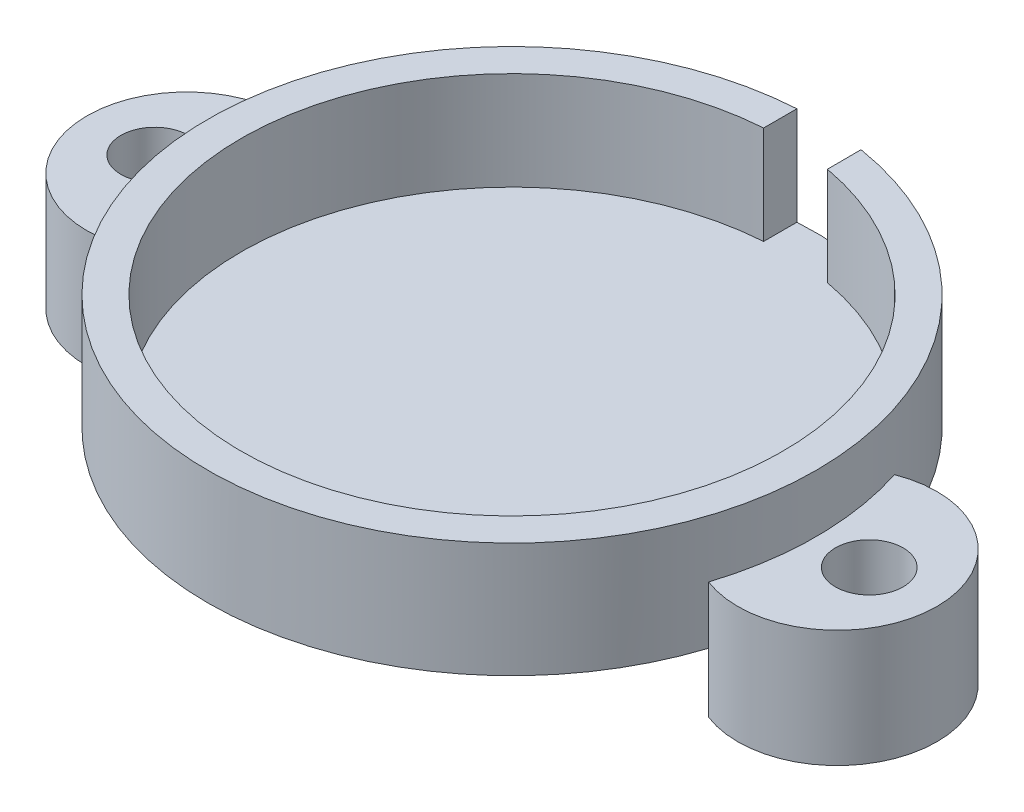
ISO-10303-21;
HEADER;
FILE_DESCRIPTION(('STEP AP214'),'2;1');
FILE_NAME('part.step','',(''),(''),'','','');
FILE_SCHEMA(('AUTOMOTIVE_DESIGN { 1 0 10303 214 1 1 1 1 }'));
ENDSEC;
DATA;
#1=APPLICATION_CONTEXT('core data for automotive mechanical design processes');
#2=APPLICATION_PROTOCOL_DEFINITION('international standard','automotive_design',2000,#1);
#3=PRODUCT_CONTEXT('',#1,'mechanical');
#4=PRODUCT('Part','Part','',(#3));
#5=PRODUCT_RELATED_PRODUCT_CATEGORY('part','',(#4));
#6=PRODUCT_DEFINITION_FORMATION('','',#4);
#7=PRODUCT_DEFINITION_CONTEXT('part definition',#1,'design');
#8=PRODUCT_DEFINITION('design','',#6,#7);
#9=PRODUCT_DEFINITION_SHAPE('','',#8);
#10=(LENGTH_UNIT() NAMED_UNIT(*) SI_UNIT(.MILLI.,.METRE.));
#11=(NAMED_UNIT(*) PLANE_ANGLE_UNIT() SI_UNIT($,.RADIAN.));
#12=(NAMED_UNIT(*) SI_UNIT($,.STERADIAN.) SOLID_ANGLE_UNIT());
#13=UNCERTAINTY_MEASURE_WITH_UNIT(LENGTH_MEASURE(1.E-05),#10,'distance_accuracy_value','');
#14=(GEOMETRIC_REPRESENTATION_CONTEXT(3) GLOBAL_UNCERTAINTY_ASSIGNED_CONTEXT((#13)) GLOBAL_UNIT_ASSIGNED_CONTEXT((#10,
#11,#12)) REPRESENTATION_CONTEXT('',''));
#15=CARTESIAN_POINT('',(0.,0.,0.));
#16=DIRECTION('',(0.,0.,1.));
#17=DIRECTION('',(1.,0.,0.));
#18=AXIS2_PLACEMENT_3D('',#15,#16,#17);
#19=CARTESIAN_POINT('',(0.,21.971,0.));
#20=DIRECTION('',(0.,-1.,0.));
#21=DIRECTION('',(0.,0.,-1.));
#22=AXIS2_PLACEMENT_3D('',#19,#20,#21);
#23=CYLINDRICAL_SURFACE('',#22,58.166);
#24=CARTESIAN_POINT('',(0.,3.175,0.));
#25=DIRECTION('',(0.,1.,0.));
#26=DIRECTION('',(0.,0.,1.));
#27=AXIS2_PLACEMENT_3D('',#24,#25,#26);
#28=CIRCLE('',#27,58.166);
#29=CARTESIAN_POINT('',(9.34075689132414,3.175,-57.4110948919909));
#30=VERTEX_POINT('',#29);
#31=CARTESIAN_POINT('',(-3.57037670971178,3.175,-58.0563171941758));
#32=VERTEX_POINT('',#31);
#33=EDGE_CURVE('E176',#30,#32,#28,.T.);
#34=ORIENTED_EDGE('',*,*,#33,.F.);
#35=DIRECTION('',(0.,1.,0.));
#36=VECTOR('',#35,1.);
#37=CARTESIAN_POINT('',(9.34075689132414,3.175,-57.4110948919909));
#38=LINE('',#37,#36);
#39=CARTESIAN_POINT('',(9.34075689132414,21.971,-57.4110948919909));
#40=VERTEX_POINT('',#39);
#41=EDGE_CURVE('E193',#30,#40,#38,.T.);
#42=ORIENTED_EDGE('',*,*,#41,.T.);
#43=CARTESIAN_POINT('',(0.,21.971,0.));
#44=DIRECTION('',(0.,1.,0.));
#45=DIRECTION('',(0.,0.,1.));
#46=AXIS2_PLACEMENT_3D('',#43,#44,#45);
#47=CIRCLE('',#46,58.166);
#48=CARTESIAN_POINT('',(-3.57037670971178,21.971,-58.0563171941758));
#49=VERTEX_POINT('',#48);
#50=EDGE_CURVE('E11',#49,#40,#47,.T.);
#51=ORIENTED_EDGE('',*,*,#50,.F.);
#52=DIRECTION('',(0.,1.,0.));
#53=VECTOR('',#52,1.);
#54=CARTESIAN_POINT('',(-3.57037670971178,3.175,-58.0563171941758));
#55=LINE('',#54,#53);
#56=EDGE_CURVE('E188',#32,#49,#55,.T.);
#57=ORIENTED_EDGE('',*,*,#56,.F.);
#58=EDGE_LOOP('',(#34,#42,#51,#57));
#59=FACE_BOUND('',#58,.T.);
#60=DIRECTION('',(0.,1.,0.));
#61=VECTOR('',#60,1.);
#62=CARTESIAN_POINT('',(55.3828857142857,-11.43,17.7769380366352));
#63=LINE('',#62,#61);
#64=CARTESIAN_POINT('',(55.3828857142857,0.,17.7769380366352));
#65=VERTEX_POINT('',#64);
#66=CARTESIAN_POINT('',(55.3828857142857,10.9855,17.7769380366352));
#67=VERTEX_POINT('',#66);
#68=EDGE_CURVE('E59',#65,#67,#63,.T.);
#69=ORIENTED_EDGE('',*,*,#68,.T.);
#70=CARTESIAN_POINT('',(0.,10.9855,0.));
#71=DIRECTION('',(0.,1.,0.));
#72=DIRECTION('',(0.,0.,1.));
#73=AXIS2_PLACEMENT_3D('',#70,#71,#72);
#74=CIRCLE('',#73,58.166);
#75=CARTESIAN_POINT('',(55.3828857142857,10.9855,-17.7769380366352));
#76=VERTEX_POINT('',#75);
#77=EDGE_CURVE('E54',#67,#76,#74,.T.);
#78=ORIENTED_EDGE('',*,*,#77,.T.);
#79=DIRECTION('',(0.,1.,0.));
#80=VECTOR('',#79,1.);
#81=CARTESIAN_POINT('',(55.3828857142857,-11.43,-17.7769380366352));
#82=LINE('',#81,#80);
#83=CARTESIAN_POINT('',(55.3828857142857,0.,-17.7769380366352));
#84=VERTEX_POINT('',#83);
#85=EDGE_CURVE('E139',#84,#76,#82,.T.);
#86=ORIENTED_EDGE('',*,*,#85,.F.);
#87=CARTESIAN_POINT('',(0.,0.,0.));
#88=DIRECTION('',(0.,1.,0.));
#89=DIRECTION('',(0.,0.,1.));
#90=AXIS2_PLACEMENT_3D('',#87,#88,#89);
#91=CIRCLE('',#90,58.166);
#92=CARTESIAN_POINT('',(-55.3828857142857,0.,-17.7769380366352));
#93=VERTEX_POINT('',#92);
#94=EDGE_CURVE('E211',#84,#93,#91,.T.);
#95=ORIENTED_EDGE('',*,*,#94,.T.);
#96=DIRECTION('',(0.,1.,0.));
#97=VECTOR('',#96,1.);
#98=CARTESIAN_POINT('',(-55.3828857142857,-11.43,-17.7769380366352));
#99=LINE('',#98,#97);
#100=CARTESIAN_POINT('',(-55.3828857142857,10.9855,-17.7769380366352));
#101=VERTEX_POINT('',#100);
#102=EDGE_CURVE('E165',#93,#101,#99,.T.);
#103=ORIENTED_EDGE('',*,*,#102,.T.);
#104=CARTESIAN_POINT('',(0.,10.9855,0.));
#105=DIRECTION('',(0.,1.,0.));
#106=DIRECTION('',(0.,0.,1.));
#107=AXIS2_PLACEMENT_3D('',#104,#105,#106);
#108=CIRCLE('',#107,58.166);
#109=CARTESIAN_POINT('',(-55.3828857142857,10.9855,17.7769380366352));
#110=VERTEX_POINT('',#109);
#111=EDGE_CURVE('E144',#101,#110,#108,.T.);
#112=ORIENTED_EDGE('',*,*,#111,.T.);
#113=DIRECTION('',(0.,1.,0.));
#114=VECTOR('',#113,1.);
#115=CARTESIAN_POINT('',(-55.3828857142857,-11.43,17.7769380366352));
#116=LINE('',#115,#114);
#117=CARTESIAN_POINT('',(-55.3828857142857,0.,17.7769380366352));
#118=VERTEX_POINT('',#117);
#119=EDGE_CURVE('E170',#118,#110,#116,.T.);
#120=ORIENTED_EDGE('',*,*,#119,.F.);
#121=EDGE_CURVE('E403',#118,#65,#91,.T.);
#122=ORIENTED_EDGE('',*,*,#121,.T.);
#123=EDGE_LOOP('',(#69,#78,#86,#95,#103,#112,#120,#122));
#124=FACE_BOUND('',#123,.T.);
#125=ADVANCED_FACE('F39',(#59,#124),#23,.T.);
#126=CARTESIAN_POINT('',(0.,21.971,0.));
#127=DIRECTION('',(0.,1.,0.));
#128=DIRECTION('',(0.,0.,1.));
#129=AXIS2_PLACEMENT_3D('',#126,#127,#128);
#130=PLANE('',#129);
#131=DIRECTION('',(-0.00345713476909509,0.,-0.999994024091738));
#132=VECTOR('',#131,1.);
#133=CARTESIAN_POINT('',(9.36304882857231,21.971,-50.9630373175871));
#134=LINE('',#133,#132);
#135=CARTESIAN_POINT('',(9.36304882857231,21.971,-50.9630373175871));
#136=VERTEX_POINT('',#135);
#137=EDGE_CURVE('E181',#136,#40,#134,.T.);
#138=ORIENTED_EDGE('',*,*,#137,.F.);
#139=CARTESIAN_POINT('',(0.,21.971,0.));
#140=DIRECTION('',(0.,1.,0.));
#141=DIRECTION('',(0.,0.,1.));
#142=AXIS2_PLACEMENT_3D('',#139,#140,#141);
#143=CIRCLE('',#142,51.816);
#144=CARTESIAN_POINT('',(-3.57037670971178,21.971,-51.6928454058272));
#145=VERTEX_POINT('',#144);
#146=EDGE_CURVE('E197',#145,#136,#143,.T.);
#147=ORIENTED_EDGE('',*,*,#146,.F.);
#148=DIRECTION('',(0.,0.,1.));
#149=VECTOR('',#148,1.);
#150=CARTESIAN_POINT('',(-3.57037670971178,21.971,-51.6928454058272));
#151=LINE('',#150,#149);
#152=EDGE_CURVE('E175',#49,#145,#151,.T.);
#153=ORIENTED_EDGE('',*,*,#152,.F.);
#154=ORIENTED_EDGE('',*,*,#50,.T.);
#155=EDGE_LOOP('',(#138,#147,#153,#154));
#156=FACE_BOUND('',#155,.T.);
#157=ADVANCED_FACE('F223',(#156),#130,.T.);
#158=CARTESIAN_POINT('',(0.,0.,0.));
#159=DIRECTION('',(0.,1.,0.));
#160=DIRECTION('',(0.,0.,1.));
#161=AXIS2_PLACEMENT_3D('',#158,#159,#160);
#162=PLANE('',#161);
#163=EDGE_CURVE('E42',#93,#118,#91,.T.);
#164=ORIENTED_EDGE('',*,*,#163,.F.);
#165=ORIENTED_EDGE('',*,*,#94,.F.);
#166=EDGE_CURVE('E136',#65,#84,#91,.T.);
#167=ORIENTED_EDGE('',*,*,#166,.F.);
#168=ORIENTED_EDGE('',*,*,#121,.F.);
#169=EDGE_LOOP('',(#164,#165,#167,#168));
#170=FACE_BOUND('',#169,.T.);
#171=ADVANCED_FACE('F250',(#170),#162,.F.);
#172=CARTESIAN_POINT('',(0.,3.175,0.));
#173=DIRECTION('',(0.,1.,0.));
#174=DIRECTION('',(0.,0.,1.));
#175=AXIS2_PLACEMENT_3D('',#172,#173,#174);
#176=CYLINDRICAL_SURFACE('',#175,51.816);
#177=ORIENTED_EDGE('',*,*,#146,.T.);
#178=DIRECTION('',(0.,1.,0.));
#179=VECTOR('',#178,1.);
#180=CARTESIAN_POINT('',(9.36304882857231,3.175,-50.9630373175871));
#181=LINE('',#180,#179);
#182=CARTESIAN_POINT('',(9.36304882857231,3.175,-50.9630373175871));
#183=VERTEX_POINT('',#182);
#184=EDGE_CURVE('E198',#183,#136,#181,.T.);
#185=ORIENTED_EDGE('',*,*,#184,.F.);
#186=CARTESIAN_POINT('',(0.,3.175,0.));
#187=DIRECTION('',(0.,1.,0.));
#188=DIRECTION('',(0.,0.,1.));
#189=AXIS2_PLACEMENT_3D('',#186,#187,#188);
#190=CIRCLE('',#189,51.816);
#191=CARTESIAN_POINT('',(-3.57037670971178,3.175,-51.6928454058272));
#192=VERTEX_POINT('',#191);
#193=EDGE_CURVE('E207',#192,#183,#190,.T.);
#194=ORIENTED_EDGE('',*,*,#193,.F.);
#195=DIRECTION('',(0.,1.,0.));
#196=VECTOR('',#195,1.);
#197=CARTESIAN_POINT('',(-3.57037670971178,3.175,-51.6928454058272));
#198=LINE('',#197,#196);
#199=EDGE_CURVE('E201',#192,#145,#198,.T.);
#200=ORIENTED_EDGE('',*,*,#199,.T.);
#201=EDGE_LOOP('',(#177,#185,#194,#200));
#202=FACE_BOUND('',#201,.T.);
#203=ADVANCED_FACE('F217',(#202),#176,.F.);
#204=CARTESIAN_POINT('',(0.,3.175,0.));
#205=DIRECTION('',(0.,1.,0.));
#206=DIRECTION('',(0.,0.,1.));
#207=AXIS2_PLACEMENT_3D('',#204,#205,#206);
#208=PLANE('',#207);
#209=ORIENTED_EDGE('',*,*,#193,.T.);
#210=DIRECTION('',(-0.00345713476909509,0.,-0.999994024091738));
#211=VECTOR('',#210,1.);
#212=CARTESIAN_POINT('',(9.36304882857231,3.175,-50.9630373175871));
#213=LINE('',#212,#211);
#214=EDGE_CURVE('E184',#183,#30,#213,.T.);
#215=ORIENTED_EDGE('',*,*,#214,.T.);
#216=ORIENTED_EDGE('',*,*,#33,.T.);
#217=DIRECTION('',(0.,0.,1.));
#218=VECTOR('',#217,1.);
#219=CARTESIAN_POINT('',(-3.57037670971178,3.175,-51.6928454058272));
#220=LINE('',#219,#218);
#221=EDGE_CURVE('E180',#32,#192,#220,.T.);
#222=ORIENTED_EDGE('',*,*,#221,.T.);
#223=EDGE_LOOP('',(#209,#215,#216,#222));
#224=FACE_BOUND('',#223,.T.);
#225=ADVANCED_FACE('F231',(#224),#208,.T.);
#226=CARTESIAN_POINT('',(9.36304882857231,3.175,-50.9630373175871));
#227=DIRECTION('',(0.999994024091739,0.,-0.00345713476909509));
#228=DIRECTION('',(-0.00345713476909509,0.,-0.999994024091739));
#229=AXIS2_PLACEMENT_3D('',#226,#227,#228);
#230=PLANE('',#229);
#231=ORIENTED_EDGE('',*,*,#137,.T.);
#232=ORIENTED_EDGE('',*,*,#41,.F.);
#233=ORIENTED_EDGE('',*,*,#214,.F.);
#234=ORIENTED_EDGE('',*,*,#184,.T.);
#235=EDGE_LOOP('',(#231,#232,#233,#234));
#236=FACE_BOUND('',#235,.T.);
#237=ADVANCED_FACE('F226',(#236),#230,.F.);
#238=CARTESIAN_POINT('',(-3.57037670971178,3.175,-51.6928454058272));
#239=DIRECTION('',(-1.,0.,0.));
#240=DIRECTION('',(0.,0.,1.));
#241=AXIS2_PLACEMENT_3D('',#238,#239,#240);
#242=PLANE('',#241);
#243=ORIENTED_EDGE('',*,*,#152,.T.);
#244=ORIENTED_EDGE('',*,*,#199,.F.);
#245=ORIENTED_EDGE('',*,*,#221,.F.);
#246=ORIENTED_EDGE('',*,*,#56,.T.);
#247=EDGE_LOOP('',(#243,#244,#245,#246));
#248=FACE_BOUND('',#247,.T.);
#249=ADVANCED_FACE('F233',(#248),#242,.F.);
#250=CARTESIAN_POINT('',(0.,-11.43,0.));
#251=DIRECTION('',(0.,1.,0.));
#252=DIRECTION('',(0.,0.,1.));
#253=AXIS2_PLACEMENT_3D('',#250,#251,#252);
#254=CYLINDRICAL_SURFACE('',#253,58.166);
#255=CARTESIAN_POINT('',(-55.3828857142857,-11.43,-17.7769380366352));
#256=VERTEX_POINT('',#255);
#257=EDGE_CURVE('E166',#256,#93,#99,.T.);
#258=ORIENTED_EDGE('',*,*,#257,.T.);
#259=ORIENTED_EDGE('',*,*,#163,.T.);
#260=CARTESIAN_POINT('',(-55.3828857142857,-11.43,17.7769380366352));
#261=VERTEX_POINT('',#260);
#262=EDGE_CURVE('E171',#261,#118,#116,.T.);
#263=ORIENTED_EDGE('',*,*,#262,.F.);
#264=CARTESIAN_POINT('',(0.,-11.43,0.));
#265=DIRECTION('',(0.,1.,0.));
#266=DIRECTION('',(0.,0.,1.));
#267=AXIS2_PLACEMENT_3D('',#264,#265,#266);
#268=CIRCLE('',#267,58.166);
#269=EDGE_CURVE('E158',#256,#261,#268,.T.);
#270=ORIENTED_EDGE('',*,*,#269,.F.);
#271=EDGE_LOOP('',(#258,#259,#263,#270));
#272=FACE_BOUND('',#271,.T.);
#273=ADVANCED_FACE('F235',(#272),#254,.F.);
#274=CARTESIAN_POINT('',(-31.115,-11.43,0.));
#275=DIRECTION('',(0.,1.,0.));
#276=DIRECTION('',(0.,0.,1.));
#277=AXIS2_PLACEMENT_3D('',#274,#275,#276);
#278=PLANE('',#277);
#279=ORIENTED_EDGE('',*,*,#269,.T.);
#280=CARTESIAN_POINT('',(-62.23,-11.43,0.));
#281=DIRECTION('',(0.,-1.,0.));
#282=DIRECTION('',(0.,0.,-1.));
#283=AXIS2_PLACEMENT_3D('',#280,#281,#282);
#284=CIRCLE('',#283,19.05);
#285=EDGE_CURVE('E162',#261,#256,#284,.T.);
#286=ORIENTED_EDGE('',*,*,#285,.T.);
#287=EDGE_LOOP('',(#279,#286));
#288=FACE_BOUND('',#287,.T.);
#289=CARTESIAN_POINT('',(-68.3238241724542,-11.43,0.));
#290=DIRECTION('',(0.,-1.,0.));
#291=DIRECTION('',(0.,0.,-1.));
#292=AXIS2_PLACEMENT_3D('',#289,#290,#291);
#293=CIRCLE('',#292,6.477);
#294=CARTESIAN_POINT('',(-68.3238241724542,-11.43,-6.477));
#295=VERTEX_POINT('',#294);
#296=EDGE_CURVE('E154',#295,#295,#293,.T.);
#297=ORIENTED_EDGE('',*,*,#296,.F.);
#298=EDGE_LOOP('',(#297));
#299=FACE_BOUND('',#298,.T.);
#300=ADVANCED_FACE('F241',(#288,#299),#278,.F.);
#301=CARTESIAN_POINT('',(-62.23,-11.43,0.));
#302=DIRECTION('',(0.,1.,0.));
#303=DIRECTION('',(0.,0.,1.));
#304=AXIS2_PLACEMENT_3D('',#301,#302,#303);
#305=CYLINDRICAL_SURFACE('',#304,19.05);
#306=ORIENTED_EDGE('',*,*,#262,.T.);
#307=ORIENTED_EDGE('',*,*,#119,.T.);
#308=CARTESIAN_POINT('',(-62.23,10.9855,0.));
#309=DIRECTION('',(0.,-1.,0.));
#310=DIRECTION('',(0.,0.,-1.));
#311=AXIS2_PLACEMENT_3D('',#308,#309,#310);
#312=CIRCLE('',#311,19.05);
#313=EDGE_CURVE('E150',#110,#101,#312,.T.);
#314=ORIENTED_EDGE('',*,*,#313,.T.);
#315=ORIENTED_EDGE('',*,*,#102,.F.);
#316=ORIENTED_EDGE('',*,*,#257,.F.);
#317=ORIENTED_EDGE('',*,*,#285,.F.);
#318=EDGE_LOOP('',(#306,#307,#314,#315,#316,#317));
#319=FACE_BOUND('',#318,.T.);
#320=ADVANCED_FACE('F299',(#319),#305,.T.);
#321=CARTESIAN_POINT('',(-68.3238241724542,-11.43,0.));
#322=DIRECTION('',(0.,1.,0.));
#323=DIRECTION('',(0.,0.,1.));
#324=AXIS2_PLACEMENT_3D('',#321,#322,#323);
#325=CYLINDRICAL_SURFACE('',#324,6.477);
#326=ORIENTED_EDGE('',*,*,#296,.T.);
#327=EDGE_LOOP('',(#326));
#328=FACE_BOUND('',#327,.T.);
#329=CARTESIAN_POINT('',(-68.3238241724542,10.9855,0.));
#330=DIRECTION('',(0.,-1.,0.));
#331=DIRECTION('',(0.,0.,-1.));
#332=AXIS2_PLACEMENT_3D('',#329,#330,#331);
#333=CIRCLE('',#332,6.477);
#334=CARTESIAN_POINT('',(-68.3238241724542,10.9855,-6.477));
#335=VERTEX_POINT('',#334);
#336=EDGE_CURVE('E138',#335,#335,#333,.T.);
#337=ORIENTED_EDGE('',*,*,#336,.F.);
#338=EDGE_LOOP('',(#337));
#339=FACE_BOUND('',#338,.T.);
#340=ADVANCED_FACE('F309',(#328,#339),#325,.F.);
#341=CARTESIAN_POINT('',(-31.115,10.9855,0.));
#342=DIRECTION('',(0.,1.,0.));
#343=DIRECTION('',(0.,0.,1.));
#344=AXIS2_PLACEMENT_3D('',#341,#342,#343);
#345=PLANE('',#344);
#346=ORIENTED_EDGE('',*,*,#336,.T.);
#347=EDGE_LOOP('',(#346));
#348=FACE_BOUND('',#347,.T.);
#349=ORIENTED_EDGE('',*,*,#111,.F.);
#350=ORIENTED_EDGE('',*,*,#313,.F.);
#351=EDGE_LOOP('',(#349,#350));
#352=FACE_BOUND('',#351,.T.);
#353=ADVANCED_FACE('F319',(#348,#352),#345,.T.);
#354=CARTESIAN_POINT('',(0.,-11.43,0.));
#355=DIRECTION('',(0.,1.,0.));
#356=DIRECTION('',(0.,0.,1.));
#357=AXIS2_PLACEMENT_3D('',#354,#355,#356);
#358=CYLINDRICAL_SURFACE('',#357,58.166);
#359=CARTESIAN_POINT('',(55.3828857142857,-11.43,17.7769380366352));
#360=VERTEX_POINT('',#359);
#361=EDGE_CURVE('E122',#360,#65,#63,.T.);
#362=ORIENTED_EDGE('',*,*,#361,.T.);
#363=ORIENTED_EDGE('',*,*,#166,.T.);
#364=CARTESIAN_POINT('',(55.3828857142857,-11.43,-17.7769380366352));
#365=VERTEX_POINT('',#364);
#366=EDGE_CURVE('E120',#365,#84,#82,.T.);
#367=ORIENTED_EDGE('',*,*,#366,.F.);
#368=CARTESIAN_POINT('',(0.,-11.43,0.));
#369=DIRECTION('',(0.,1.,0.));
#370=DIRECTION('',(0.,0.,1.));
#371=AXIS2_PLACEMENT_3D('',#368,#369,#370);
#372=CIRCLE('',#371,58.166);
#373=EDGE_CURVE('E126',#360,#365,#372,.T.);
#374=ORIENTED_EDGE('',*,*,#373,.F.);
#375=EDGE_LOOP('',(#362,#363,#367,#374));
#376=FACE_BOUND('',#375,.T.);
#377=ADVANCED_FACE('F135',(#376),#358,.F.);
#378=CARTESIAN_POINT('',(31.115,-11.43,0.));
#379=DIRECTION('',(0.,1.,0.));
#380=DIRECTION('',(0.,0.,1.));
#381=AXIS2_PLACEMENT_3D('',#378,#379,#380);
#382=PLANE('',#381);
#383=ORIENTED_EDGE('',*,*,#373,.T.);
#384=CARTESIAN_POINT('',(62.23,-11.43,0.));
#385=DIRECTION('',(0.,-1.,0.));
#386=DIRECTION('',(0.,0.,-1.));
#387=AXIS2_PLACEMENT_3D('',#384,#385,#386);
#388=CIRCLE('',#387,19.05);
#389=EDGE_CURVE('E116',#365,#360,#388,.T.);
#390=ORIENTED_EDGE('',*,*,#389,.T.);
#391=EDGE_LOOP('',(#383,#390));
#392=FACE_BOUND('',#391,.T.);
#393=CARTESIAN_POINT('',(68.326,-11.43,0.));
#394=DIRECTION('',(0.,-1.,0.));
#395=DIRECTION('',(0.,0.,-1.));
#396=AXIS2_PLACEMENT_3D('',#393,#394,#395);
#397=CIRCLE('',#396,6.477);
#398=CARTESIAN_POINT('',(68.326,-11.43,-6.477));
#399=VERTEX_POINT('',#398);
#400=EDGE_CURVE('E132',#399,#399,#397,.T.);
#401=ORIENTED_EDGE('',*,*,#400,.F.);
#402=EDGE_LOOP('',(#401));
#403=FACE_BOUND('',#402,.T.);
#404=ADVANCED_FACE('F128',(#392,#403),#382,.F.);
#405=CARTESIAN_POINT('',(62.23,-11.43,0.));
#406=DIRECTION('',(0.,1.,0.));
#407=DIRECTION('',(0.,0.,1.));
#408=AXIS2_PLACEMENT_3D('',#405,#406,#407);
#409=CYLINDRICAL_SURFACE('',#408,19.05);
#410=ORIENTED_EDGE('',*,*,#366,.T.);
#411=ORIENTED_EDGE('',*,*,#85,.T.);
#412=CARTESIAN_POINT('',(62.23,10.9855,0.));
#413=DIRECTION('',(0.,-1.,0.));
#414=DIRECTION('',(0.,0.,-1.));
#415=AXIS2_PLACEMENT_3D('',#412,#413,#414);
#416=CIRCLE('',#415,19.05);
#417=EDGE_CURVE('E384',#76,#67,#416,.T.);
#418=ORIENTED_EDGE('',*,*,#417,.T.);
#419=ORIENTED_EDGE('',*,*,#68,.F.);
#420=ORIENTED_EDGE('',*,*,#361,.F.);
#421=ORIENTED_EDGE('',*,*,#389,.F.);
#422=EDGE_LOOP('',(#410,#411,#418,#419,#420,#421));
#423=FACE_BOUND('',#422,.T.);
#424=ADVANCED_FACE('F118',(#423),#409,.T.);
#425=CARTESIAN_POINT('',(68.326,-11.43,0.));
#426=DIRECTION('',(0.,1.,0.));
#427=DIRECTION('',(0.,0.,1.));
#428=AXIS2_PLACEMENT_3D('',#425,#426,#427);
#429=CYLINDRICAL_SURFACE('',#428,6.477);
#430=ORIENTED_EDGE('',*,*,#400,.T.);
#431=EDGE_LOOP('',(#430));
#432=FACE_BOUND('',#431,.T.);
#433=CARTESIAN_POINT('',(68.326,10.9855,0.));
#434=DIRECTION('',(0.,-1.,0.));
#435=DIRECTION('',(0.,0.,-1.));
#436=AXIS2_PLACEMENT_3D('',#433,#434,#435);
#437=CIRCLE('',#436,6.477);
#438=CARTESIAN_POINT('',(68.326,10.9855,-6.477));
#439=VERTEX_POINT('',#438);
#440=EDGE_CURVE('E381',#439,#439,#437,.T.);
#441=ORIENTED_EDGE('',*,*,#440,.F.);
#442=EDGE_LOOP('',(#441));
#443=FACE_BOUND('',#442,.T.);
#444=ADVANCED_FACE('F355',(#432,#443),#429,.F.);
#445=CARTESIAN_POINT('',(31.115,10.9855,0.));
#446=DIRECTION('',(0.,1.,0.));
#447=DIRECTION('',(0.,0.,1.));
#448=AXIS2_PLACEMENT_3D('',#445,#446,#447);
#449=PLANE('',#448);
#450=ORIENTED_EDGE('',*,*,#440,.T.);
#451=EDGE_LOOP('',(#450));
#452=FACE_BOUND('',#451,.T.);
#453=ORIENTED_EDGE('',*,*,#77,.F.);
#454=ORIENTED_EDGE('',*,*,#417,.F.);
#455=EDGE_LOOP('',(#453,#454));
#456=FACE_BOUND('',#455,.T.);
#457=ADVANCED_FACE('F364',(#452,#456),#449,.T.);
#458=CLOSED_SHELL('',(#125,#157,#171,#203,#225,#237,#249,#273,#300,#320,#340,#353,#377,#404,
#424,#444,#457));
#459=MANIFOLD_SOLID_BREP('B2',#458);
#460=ADVANCED_BREP_SHAPE_REPRESENTATION('',(#18,#459),#14);
#461=SHAPE_DEFINITION_REPRESENTATION(#9,#460);
ENDSEC;
END-ISO-10303-21;
